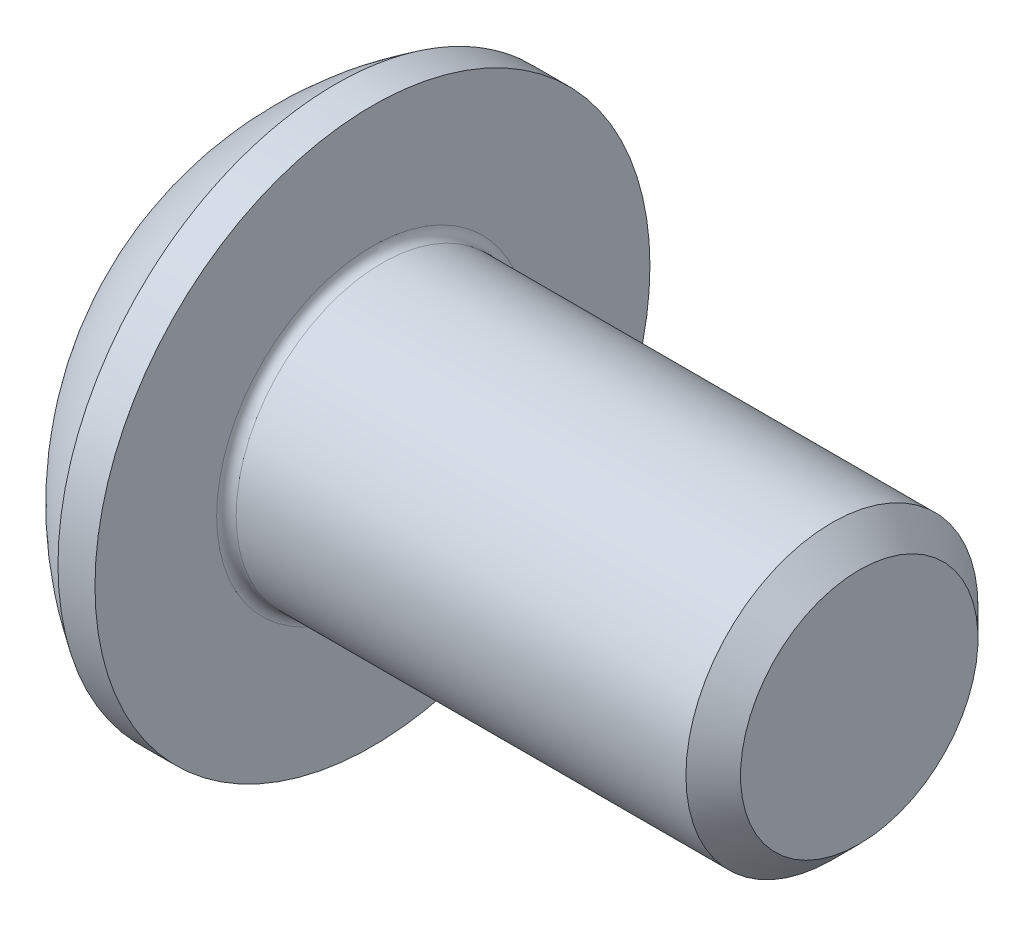
ISO-10303-21;
HEADER;
FILE_DESCRIPTION(('STEP AP214'),'2;1');
FILE_NAME('part.step','',(''),(''),'','','');
FILE_SCHEMA(('AUTOMOTIVE_DESIGN { 1 0 10303 214 1 1 1 1 }'));
ENDSEC;
DATA;
#1=APPLICATION_CONTEXT('core data for automotive mechanical design processes');
#2=APPLICATION_PROTOCOL_DEFINITION('international standard','automotive_design',2000,#1);
#3=PRODUCT_CONTEXT('',#1,'mechanical');
#4=PRODUCT('Part','Part','',(#3));
#5=PRODUCT_RELATED_PRODUCT_CATEGORY('part','',(#4));
#6=PRODUCT_DEFINITION_FORMATION('','',#4);
#7=PRODUCT_DEFINITION_CONTEXT('part definition',#1,'design');
#8=PRODUCT_DEFINITION('design','',#6,#7);
#9=PRODUCT_DEFINITION_SHAPE('','',#8);
#10=(LENGTH_UNIT() NAMED_UNIT(*) SI_UNIT(.MILLI.,.METRE.));
#11=(NAMED_UNIT(*) PLANE_ANGLE_UNIT() SI_UNIT($,.RADIAN.));
#12=(NAMED_UNIT(*) SI_UNIT($,.STERADIAN.) SOLID_ANGLE_UNIT());
#13=UNCERTAINTY_MEASURE_WITH_UNIT(LENGTH_MEASURE(1.E-05),#10,'distance_accuracy_value','');
#14=(GEOMETRIC_REPRESENTATION_CONTEXT(3) GLOBAL_UNCERTAINTY_ASSIGNED_CONTEXT((#13)) GLOBAL_UNIT_ASSIGNED_CONTEXT((#10,
#11,#12)) REPRESENTATION_CONTEXT('',''));
#15=CARTESIAN_POINT('',(0.,0.,0.));
#16=DIRECTION('',(0.,0.,1.));
#17=DIRECTION('',(1.,0.,0.));
#18=AXIS2_PLACEMENT_3D('',#15,#16,#17);
#19=CARTESIAN_POINT('',(1.04000000000026,0.,0.));
#20=DIRECTION('',(-1.,0.,0.));
#21=DIRECTION('',(0.,0.,1.));
#22=AXIS2_PLACEMENT_3D('',#19,#20,#21);
#23=CONICAL_SURFACE('',#22,0.99999999999989,1.04719755119658);
#24=CARTESIAN_POINT('',(1.61735026918985,0.,3.33066907387547E-13));
#25=VERTEX_POINT('',#24);
#26=VERTEX_LOOP('',#25);
#27=FACE_BOUND('',#26,.T.);
#28=CARTESIAN_POINT('',(1.04000000000013,0.,0.));
#29=DIRECTION('',(-1.,0.,0.));
#30=DIRECTION('',(0.,0.,1.));
#31=AXIS2_PLACEMENT_3D('',#28,#29,#30);
#32=CIRCLE('',#31,1.00000000000011);
#33=CARTESIAN_POINT('',(1.04000000000007,-0.866025403784487,0.500000000000026));
#34=VERTEX_POINT('',#33);
#35=CARTESIAN_POINT('',(1.04000000000016,0.,0.999999999999973));
#36=VERTEX_POINT('',#35);
#37=EDGE_CURVE('E98',#34,#36,#32,.T.);
#38=ORIENTED_EDGE('',*,*,#37,.T.);
#39=CARTESIAN_POINT('',(1.04000000000013,0.,0.));
#40=DIRECTION('',(-1.,0.,0.));
#41=DIRECTION('',(0.,0.,1.));
#42=AXIS2_PLACEMENT_3D('',#39,#40,#41);
#43=CIRCLE('',#42,1.00000000000011);
#44=CARTESIAN_POINT('',(1.04000000000007,0.866025403784489,0.500000000000026));
#45=VERTEX_POINT('',#44);
#46=EDGE_CURVE('E159',#36,#45,#43,.T.);
#47=ORIENTED_EDGE('',*,*,#46,.T.);
#48=CARTESIAN_POINT('',(1.04000000000013,0.,0.));
#49=DIRECTION('',(-1.,0.,0.));
#50=DIRECTION('',(0.,0.,1.));
#51=AXIS2_PLACEMENT_3D('',#48,#49,#50);
#52=CIRCLE('',#51,1.00000000000011);
#53=CARTESIAN_POINT('',(1.04000000000007,0.866025403784489,-0.500000000000027));
#54=VERTEX_POINT('',#53);
#55=EDGE_CURVE('E356',#45,#54,#52,.T.);
#56=ORIENTED_EDGE('',*,*,#55,.T.);
#57=CARTESIAN_POINT('',(1.04000000000013,0.,0.));
#58=DIRECTION('',(-1.,0.,0.));
#59=DIRECTION('',(0.,0.,1.));
#60=AXIS2_PLACEMENT_3D('',#57,#58,#59);
#61=CIRCLE('',#60,1.00000000000011);
#62=CARTESIAN_POINT('',(1.04000000000016,0.,-0.999999999999973));
#63=VERTEX_POINT('',#62);
#64=EDGE_CURVE('E357',#54,#63,#61,.T.);
#65=ORIENTED_EDGE('',*,*,#64,.T.);
#66=CARTESIAN_POINT('',(1.04000000000013,0.,0.));
#67=DIRECTION('',(-1.,0.,0.));
#68=DIRECTION('',(0.,0.,1.));
#69=AXIS2_PLACEMENT_3D('',#66,#67,#68);
#70=CIRCLE('',#69,1.00000000000011);
#71=CARTESIAN_POINT('',(1.04000000000007,-0.866025403784488,-0.500000000000025));
#72=VERTEX_POINT('',#71);
#73=EDGE_CURVE('E101',#63,#72,#70,.T.);
#74=ORIENTED_EDGE('',*,*,#73,.T.);
#75=CARTESIAN_POINT('',(1.04000000000013,0.,0.));
#76=DIRECTION('',(-1.,0.,0.));
#77=DIRECTION('',(0.,0.,1.));
#78=AXIS2_PLACEMENT_3D('',#75,#76,#77);
#79=CIRCLE('',#78,1.00000000000011);
#80=EDGE_CURVE('E96',#72,#34,#79,.T.);
#81=ORIENTED_EDGE('',*,*,#80,.T.);
#82=EDGE_LOOP('',(#38,#47,#56,#65,#74,#81));
#83=FACE_BOUND('',#82,.T.);
#84=ADVANCED_FACE('F17',(#27,#83),#23,.F.);
#85=CARTESIAN_POINT('',(1.04,-1.73205080756887,-0.999999999999999));
#86=DIRECTION('',(1.,0.,0.));
#87=DIRECTION('',(0.,0.,-1.));
#88=AXIS2_PLACEMENT_3D('',#85,#86,#87);
#89=PLANE('',#88);
#90=DIRECTION('',(0.,0.499999999999999,0.866025403784439));
#91=VECTOR('',#90,1.);
#92=CARTESIAN_POINT('',(1.04,-1.15470053837925,0.));
#93=LINE('',#92,#91);
#94=CARTESIAN_POINT('',(1.04,-0.577350269189625,0.999999999999999));
#95=VERTEX_POINT('',#94);
#96=EDGE_CURVE('E110',#95,#34,#93,.F.);
#97=ORIENTED_EDGE('',*,*,#96,.F.);
#98=DIRECTION('',(0.,1.,0.));
#99=VECTOR('',#98,1.);
#100=CARTESIAN_POINT('',(1.04,-0.577350269189625,0.999999999999998));
#101=LINE('',#100,#99);
#102=EDGE_CURVE('E112',#36,#95,#101,.F.);
#103=ORIENTED_EDGE('',*,*,#102,.F.);
#104=ORIENTED_EDGE('',*,*,#37,.F.);
#105=EDGE_LOOP('',(#97,#103,#104));
#106=FACE_BOUND('',#105,.T.);
#107=ADVANCED_FACE('F108',(#106),#89,.F.);
#108=CARTESIAN_POINT('',(1.04,-1.73205080756887,-0.999999999999999));
#109=DIRECTION('',(1.,0.,0.));
#110=DIRECTION('',(0.,0.,-1.));
#111=AXIS2_PLACEMENT_3D('',#108,#109,#110);
#112=PLANE('',#111);
#113=DIRECTION('',(0.,-0.499999999999997,0.86602540378444));
#114=VECTOR('',#113,1.);
#115=CARTESIAN_POINT('',(1.04,-0.577350269189626,-1.));
#116=LINE('',#115,#114);
#117=CARTESIAN_POINT('',(1.04,-1.15470053837925,0.));
#118=VERTEX_POINT('',#117);
#119=EDGE_CURVE('E119',#118,#72,#116,.F.);
#120=ORIENTED_EDGE('',*,*,#119,.F.);
#121=DIRECTION('',(0.,0.499999999999999,0.866025403784439));
#122=VECTOR('',#121,1.);
#123=CARTESIAN_POINT('',(1.04,-1.15470053837925,0.));
#124=LINE('',#123,#122);
#125=EDGE_CURVE('E116',#34,#118,#124,.F.);
#126=ORIENTED_EDGE('',*,*,#125,.F.);
#127=ORIENTED_EDGE('',*,*,#80,.F.);
#128=EDGE_LOOP('',(#120,#126,#127));
#129=FACE_BOUND('',#128,.T.);
#130=ADVANCED_FACE('F117',(#129),#112,.F.);
#131=CARTESIAN_POINT('',(1.04,-1.73205080756887,-0.999999999999999));
#132=DIRECTION('',(1.,0.,0.));
#133=DIRECTION('',(0.,0.,-1.));
#134=AXIS2_PLACEMENT_3D('',#131,#132,#133);
#135=PLANE('',#134);
#136=DIRECTION('',(0.,-1.,0.));
#137=VECTOR('',#136,1.);
#138=CARTESIAN_POINT('',(1.04,0.577350269189628,-1.));
#139=LINE('',#138,#137);
#140=CARTESIAN_POINT('',(1.04,-0.577350269189626,-1.));
#141=VERTEX_POINT('',#140);
#142=EDGE_CURVE('E325',#141,#63,#139,.F.);
#143=ORIENTED_EDGE('',*,*,#142,.F.);
#144=DIRECTION('',(0.,-0.499999999999997,0.86602540378444));
#145=VECTOR('',#144,1.);
#146=CARTESIAN_POINT('',(1.04,-0.577350269189626,-1.));
#147=LINE('',#146,#145);
#148=EDGE_CURVE('E337',#72,#141,#147,.F.);
#149=ORIENTED_EDGE('',*,*,#148,.F.);
#150=ORIENTED_EDGE('',*,*,#73,.F.);
#151=EDGE_LOOP('',(#143,#149,#150));
#152=FACE_BOUND('',#151,.T.);
#153=ADVANCED_FACE('F203',(#152),#135,.F.);
#154=CARTESIAN_POINT('',(1.04,-1.73205080756887,-0.999999999999999));
#155=DIRECTION('',(1.,0.,0.));
#156=DIRECTION('',(0.,0.,-1.));
#157=AXIS2_PLACEMENT_3D('',#154,#155,#156);
#158=PLANE('',#157);
#159=DIRECTION('',(0.,-0.499999999999998,-0.86602540378444));
#160=VECTOR('',#159,1.);
#161=CARTESIAN_POINT('',(1.04,1.15470053837925,0.));
#162=LINE('',#161,#160);
#163=CARTESIAN_POINT('',(1.04,0.577350269189628,-1.));
#164=VERTEX_POINT('',#163);
#165=EDGE_CURVE('E310',#164,#54,#162,.F.);
#166=ORIENTED_EDGE('',*,*,#165,.F.);
#167=DIRECTION('',(0.,-1.,0.));
#168=VECTOR('',#167,1.);
#169=CARTESIAN_POINT('',(1.04,0.577350269189628,-1.));
#170=LINE('',#169,#168);
#171=EDGE_CURVE('E322',#63,#164,#170,.F.);
#172=ORIENTED_EDGE('',*,*,#171,.F.);
#173=ORIENTED_EDGE('',*,*,#64,.F.);
#174=EDGE_LOOP('',(#166,#172,#173));
#175=FACE_BOUND('',#174,.T.);
#176=ADVANCED_FACE('F199',(#175),#158,.F.);
#177=CARTESIAN_POINT('',(1.04,-1.73205080756887,-0.999999999999999));
#178=DIRECTION('',(1.,0.,0.));
#179=DIRECTION('',(0.,0.,-1.));
#180=AXIS2_PLACEMENT_3D('',#177,#178,#179);
#181=PLANE('',#180);
#182=DIRECTION('',(0.,0.499999999999998,-0.86602540378444));
#183=VECTOR('',#182,1.);
#184=CARTESIAN_POINT('',(1.04,0.577350269189628,1.));
#185=LINE('',#184,#183);
#186=CARTESIAN_POINT('',(1.04,1.15470053837925,0.));
#187=VERTEX_POINT('',#186);
#188=EDGE_CURVE('E288',#187,#45,#185,.F.);
#189=ORIENTED_EDGE('',*,*,#188,.F.);
#190=DIRECTION('',(0.,-0.499999999999998,-0.86602540378444));
#191=VECTOR('',#190,1.);
#192=CARTESIAN_POINT('',(1.04,1.15470053837925,0.));
#193=LINE('',#192,#191);
#194=EDGE_CURVE('E307',#54,#187,#193,.F.);
#195=ORIENTED_EDGE('',*,*,#194,.F.);
#196=ORIENTED_EDGE('',*,*,#55,.F.);
#197=EDGE_LOOP('',(#189,#195,#196));
#198=FACE_BOUND('',#197,.T.);
#199=ADVANCED_FACE('F195',(#198),#181,.F.);
#200=CARTESIAN_POINT('',(1.04,-1.73205080756887,-0.999999999999999));
#201=DIRECTION('',(1.,0.,0.));
#202=DIRECTION('',(0.,0.,-1.));
#203=AXIS2_PLACEMENT_3D('',#200,#201,#202);
#204=PLANE('',#203);
#205=DIRECTION('',(0.,1.,0.));
#206=VECTOR('',#205,1.);
#207=CARTESIAN_POINT('',(1.04,-0.577350269189625,0.999999999999998));
#208=LINE('',#207,#206);
#209=CARTESIAN_POINT('',(1.04,0.577350269189628,1.));
#210=VERTEX_POINT('',#209);
#211=EDGE_CURVE('E128',#210,#36,#208,.F.);
#212=ORIENTED_EDGE('',*,*,#211,.F.);
#213=DIRECTION('',(0.,0.499999999999998,-0.86602540378444));
#214=VECTOR('',#213,1.);
#215=CARTESIAN_POINT('',(1.04,0.577350269189628,1.));
#216=LINE('',#215,#214);
#217=EDGE_CURVE('E291',#45,#210,#216,.F.);
#218=ORIENTED_EDGE('',*,*,#217,.F.);
#219=ORIENTED_EDGE('',*,*,#46,.F.);
#220=EDGE_LOOP('',(#212,#218,#219));
#221=FACE_BOUND('',#220,.T.);
#222=ADVANCED_FACE('F191',(#221),#204,.F.);
#223=CARTESIAN_POINT('',(1.04,-0.577350269189625,0.999999999999998));
#224=DIRECTION('',(0.,0.,-1.));
#225=DIRECTION('',(0.,1.,0.));
#226=AXIS2_PLACEMENT_3D('',#223,#224,#225);
#227=PLANE('',#226);
#228=DIRECTION('',(0.,1.,0.));
#229=VECTOR('',#228,1.);
#230=CARTESIAN_POINT('',(0.,0.,1.));
#231=LINE('',#230,#229);
#232=CARTESIAN_POINT('',(0.,0.577350269189628,1.));
#233=VERTEX_POINT('',#232);
#234=CARTESIAN_POINT('',(0.,-0.577350269189625,0.999999999999999));
#235=VERTEX_POINT('',#234);
#236=EDGE_CURVE('E284',#233,#235,#231,.F.);
#237=ORIENTED_EDGE('',*,*,#236,.F.);
#238=DIRECTION('',(1.,0.,0.));
#239=VECTOR('',#238,1.);
#240=CARTESIAN_POINT('',(1.04,0.577350269189628,1.));
#241=LINE('',#240,#239);
#242=EDGE_CURVE('E297',#210,#233,#241,.F.);
#243=ORIENTED_EDGE('',*,*,#242,.F.);
#244=ORIENTED_EDGE('',*,*,#211,.T.);
#245=ORIENTED_EDGE('',*,*,#102,.T.);
#246=DIRECTION('',(1.,0.,0.));
#247=VECTOR('',#246,1.);
#248=CARTESIAN_POINT('',(1.04,-0.577350269189625,0.999999999999999));
#249=LINE('',#248,#247);
#250=EDGE_CURVE('E122',#235,#95,#249,.T.);
#251=ORIENTED_EDGE('',*,*,#250,.F.);
#252=EDGE_LOOP('',(#237,#243,#244,#245,#251));
#253=FACE_BOUND('',#252,.T.);
#254=ADVANCED_FACE('F188',(#253),#227,.T.);
#255=CARTESIAN_POINT('',(1.04,-1.15470053837925,0.));
#256=DIRECTION('',(0.,0.866025403784439,-0.499999999999999));
#257=DIRECTION('',(0.,0.499999999999999,0.866025403784439));
#258=AXIS2_PLACEMENT_3D('',#255,#256,#257);
#259=PLANE('',#258);
#260=DIRECTION('',(0.,-0.499999999999999,-0.866025403784439));
#261=VECTOR('',#260,1.);
#262=CARTESIAN_POINT('',(0.,-0.577350269189625,0.999999999999998));
#263=LINE('',#262,#261);
#264=CARTESIAN_POINT('',(0.,-1.15470053837925,0.));
#265=VERTEX_POINT('',#264);
#266=EDGE_CURVE('E281',#235,#265,#263,.T.);
#267=ORIENTED_EDGE('',*,*,#266,.F.);
#268=ORIENTED_EDGE('',*,*,#250,.T.);
#269=ORIENTED_EDGE('',*,*,#96,.T.);
#270=ORIENTED_EDGE('',*,*,#125,.T.);
#271=DIRECTION('',(1.,0.,0.));
#272=VECTOR('',#271,1.);
#273=CARTESIAN_POINT('',(1.04,-1.15470053837925,0.));
#274=LINE('',#273,#272);
#275=EDGE_CURVE('E334',#265,#118,#274,.T.);
#276=ORIENTED_EDGE('',*,*,#275,.F.);
#277=EDGE_LOOP('',(#267,#268,#269,#270,#276));
#278=FACE_BOUND('',#277,.T.);
#279=ADVANCED_FACE('F126',(#278),#259,.T.);
#280=CARTESIAN_POINT('',(1.04,-0.577350269189626,-1.));
#281=DIRECTION('',(0.,0.86602540378444,0.499999999999997));
#282=DIRECTION('',(0.,-0.499999999999997,0.86602540378444));
#283=AXIS2_PLACEMENT_3D('',#280,#281,#282);
#284=PLANE('',#283);
#285=DIRECTION('',(0.,0.499999999999997,-0.86602540378444));
#286=VECTOR('',#285,1.);
#287=CARTESIAN_POINT('',(0.,-1.15470053837925,0.));
#288=LINE('',#287,#286);
#289=CARTESIAN_POINT('',(0.,-0.577350269189626,-1.));
#290=VERTEX_POINT('',#289);
#291=EDGE_CURVE('E278',#265,#290,#288,.T.);
#292=ORIENTED_EDGE('',*,*,#291,.F.);
#293=ORIENTED_EDGE('',*,*,#275,.T.);
#294=ORIENTED_EDGE('',*,*,#119,.T.);
#295=ORIENTED_EDGE('',*,*,#148,.T.);
#296=DIRECTION('',(1.,0.,0.));
#297=VECTOR('',#296,1.);
#298=CARTESIAN_POINT('',(1.04,-0.577350269189626,-1.));
#299=LINE('',#298,#297);
#300=EDGE_CURVE('E319',#290,#141,#299,.T.);
#301=ORIENTED_EDGE('',*,*,#300,.F.);
#302=EDGE_LOOP('',(#292,#293,#294,#295,#301));
#303=FACE_BOUND('',#302,.T.);
#304=ADVANCED_FACE('F181',(#303),#284,.T.);
#305=CARTESIAN_POINT('',(1.04,0.577350269189628,-1.));
#306=DIRECTION('',(0.,0.,1.));
#307=DIRECTION('',(0.,-1.,0.));
#308=AXIS2_PLACEMENT_3D('',#305,#306,#307);
#309=PLANE('',#308);
#310=DIRECTION('',(0.,1.,0.));
#311=VECTOR('',#310,1.);
#312=CARTESIAN_POINT('',(0.,0.,-1.));
#313=LINE('',#312,#311);
#314=CARTESIAN_POINT('',(0.,0.577350269189628,-1.));
#315=VERTEX_POINT('',#314);
#316=EDGE_CURVE('E275',#290,#315,#313,.T.);
#317=ORIENTED_EDGE('',*,*,#316,.F.);
#318=ORIENTED_EDGE('',*,*,#300,.T.);
#319=ORIENTED_EDGE('',*,*,#142,.T.);
#320=ORIENTED_EDGE('',*,*,#171,.T.);
#321=DIRECTION('',(1.,0.,0.));
#322=VECTOR('',#321,1.);
#323=CARTESIAN_POINT('',(1.04,0.577350269189628,-1.));
#324=LINE('',#323,#322);
#325=EDGE_CURVE('E292',#315,#164,#324,.T.);
#326=ORIENTED_EDGE('',*,*,#325,.F.);
#327=EDGE_LOOP('',(#317,#318,#319,#320,#326));
#328=FACE_BOUND('',#327,.T.);
#329=ADVANCED_FACE('F177',(#328),#309,.T.);
#330=CARTESIAN_POINT('',(1.04,1.15470053837925,0.));
#331=DIRECTION('',(0.,-0.86602540378444,0.499999999999998));
#332=DIRECTION('',(0.,-0.499999999999998,-0.86602540378444));
#333=AXIS2_PLACEMENT_3D('',#330,#331,#332);
#334=PLANE('',#333);
#335=DIRECTION('',(0.,0.499999999999998,0.866025403784439));
#336=VECTOR('',#335,1.);
#337=CARTESIAN_POINT('',(0.,0.577350269189628,-1.));
#338=LINE('',#337,#336);
#339=CARTESIAN_POINT('',(0.,1.15470053837925,0.));
#340=VERTEX_POINT('',#339);
#341=EDGE_CURVE('E272',#315,#340,#338,.T.);
#342=ORIENTED_EDGE('',*,*,#341,.F.);
#343=ORIENTED_EDGE('',*,*,#325,.T.);
#344=ORIENTED_EDGE('',*,*,#165,.T.);
#345=ORIENTED_EDGE('',*,*,#194,.T.);
#346=DIRECTION('',(1.,0.,0.));
#347=VECTOR('',#346,1.);
#348=CARTESIAN_POINT('',(1.04,1.15470053837925,0.));
#349=LINE('',#348,#347);
#350=EDGE_CURVE('E287',#340,#187,#349,.T.);
#351=ORIENTED_EDGE('',*,*,#350,.F.);
#352=EDGE_LOOP('',(#342,#343,#344,#345,#351));
#353=FACE_BOUND('',#352,.T.);
#354=ADVANCED_FACE('F173',(#353),#334,.T.);
#355=CARTESIAN_POINT('',(1.04,0.577350269189628,1.));
#356=DIRECTION('',(0.,-0.86602540378444,-0.499999999999998));
#357=DIRECTION('',(0.,0.499999999999998,-0.86602540378444));
#358=AXIS2_PLACEMENT_3D('',#355,#356,#357);
#359=PLANE('',#358);
#360=DIRECTION('',(0.,-0.499999999999998,0.866025403784439));
#361=VECTOR('',#360,1.);
#362=CARTESIAN_POINT('',(0.,1.15470053837925,0.));
#363=LINE('',#362,#361);
#364=EDGE_CURVE('E158',#340,#233,#363,.T.);
#365=ORIENTED_EDGE('',*,*,#364,.F.);
#366=ORIENTED_EDGE('',*,*,#350,.T.);
#367=ORIENTED_EDGE('',*,*,#188,.T.);
#368=ORIENTED_EDGE('',*,*,#217,.T.);
#369=ORIENTED_EDGE('',*,*,#242,.T.);
#370=EDGE_LOOP('',(#365,#366,#367,#368,#369));
#371=FACE_BOUND('',#370,.T.);
#372=ADVANCED_FACE('F169',(#371),#359,.T.);
#373=CARTESIAN_POINT('',(0.,0.,0.));
#374=DIRECTION('',(-1.,0.,0.));
#375=DIRECTION('',(0.,0.,1.));
#376=AXIS2_PLACEMENT_3D('',#373,#374,#375);
#377=PLANE('',#376);
#378=ORIENTED_EDGE('',*,*,#341,.T.);
#379=ORIENTED_EDGE('',*,*,#364,.T.);
#380=ORIENTED_EDGE('',*,*,#236,.T.);
#381=ORIENTED_EDGE('',*,*,#266,.T.);
#382=ORIENTED_EDGE('',*,*,#291,.T.);
#383=ORIENTED_EDGE('',*,*,#316,.T.);
#384=EDGE_LOOP('',(#378,#379,#380,#381,#382,#383));
#385=FACE_BOUND('',#384,.T.);
#386=CARTESIAN_POINT('',(0.,1.425,0.));
#387=CARTESIAN_POINT('',(1.4338123437925E-13,1.4249954713384,0.0799833360146291));
#388=CARTESIAN_POINT('',(1.15184834850223E-13,1.41822890220767,0.160109019716956));
#389=CARTESIAN_POINT('',(0.,1.39809415024756,0.278523524351213));
#390=CARTESIAN_POINT('',(-1.36371698945797E-13,1.38970085869302,0.317749539599063));
#391=CARTESIAN_POINT('',(1.37350310557856E-13,1.36963357855865,0.395393827236254));
#392=CARTESIAN_POINT('',(4.90702889339482E-13,1.35795692767265,0.433811416830825));
#393=CARTESIAN_POINT('',(8.08323358908285E-13,1.31816256652494,0.547245538496227));
#394=CARTESIAN_POINT('',(0.,1.28524776326109,0.620634351866309));
#395=CARTESIAN_POINT('',(0.,1.20754836567178,0.760838579302564));
#396=CARTESIAN_POINT('',(6.6863372592463E-13,1.16276332012518,0.827653743353507));
#397=CARTESIAN_POINT('',(4.22782595577366E-13,1.08769646787854,0.921494986115556));
#398=CARTESIAN_POINT('',(1.23450677297426E-13,1.06133948212697,0.951729494931907));
#399=CARTESIAN_POINT('',(-1.22464708646666E-13,1.00620185445047,1.00984457256203));
#400=CARTESIAN_POINT('',(0.,0.977423573796233,1.03772738282292));
#401=CARTESIAN_POINT('',(1.40032245964886E-13,0.887686851976215,1.11760418663801));
#402=CARTESIAN_POINT('',(3.46567737658904E-13,0.82331026114336,1.16584685143027));
#403=CARTESIAN_POINT('',(3.19566586273256E-13,0.687406523979006,1.25081092212941));
#404=CARTESIAN_POINT('',(0.,0.615879647408102,1.28753276246912));
#405=CARTESIAN_POINT('',(0.,0.467668101636277,1.34845363272005));
#406=CARTESIAN_POINT('',(0.,0.390983487532283,1.3726527963793));
#407=CARTESIAN_POINT('',(0.,0.234641768263904,1.40783152102361));
#408=CARTESIAN_POINT('',(0.,0.154984647227414,1.41881101141001));
#409=CARTESIAN_POINT('',(0.,-0.0050423119243791,1.42724192135212));
#410=CARTESIAN_POINT('',(0.,-0.0854121500396832,1.42469334090783));
#411=CARTESIAN_POINT('',(0.,-0.244584849637596,1.40613727575181));
#412=CARTESIAN_POINT('',(0.,-0.323387719486151,1.39012986291571));
#413=CARTESIAN_POINT('',(0.,-0.477180160001693,1.34511986433297));
#414=CARTESIAN_POINT('',(0.,-0.552169689930598,1.31611713978929));
#415=CARTESIAN_POINT('',(0.,-0.696248843253839,1.2459037745185));
#416=CARTESIAN_POINT('',(0.,-0.765338244029829,1.2046926734179));
#417=CARTESIAN_POINT('',(0.,-0.862971403767651,1.13468732254875));
#418=CARTESIAN_POINT('',(0.,-0.894520211596415,1.10998280332573));
#419=CARTESIAN_POINT('',(0.,-0.955459158435813,1.05798313994378));
#420=CARTESIAN_POINT('',(0.,-0.984847184771994,1.03068551863103));
#421=CARTESIAN_POINT('',(0.,-1.06935902683459,0.94525156928671));
#422=CARTESIAN_POINT('',(0.,-1.12091688115598,0.883512164450251));
#423=CARTESIAN_POINT('',(0.,-1.21291837674087,0.752248511496185));
#424=CARTESIAN_POINT('',(0.,-1.25336244045678,0.682724559422701));
#425=CARTESIAN_POINT('',(0.,-1.30485581691191,0.574099869234607));
#426=CARTESIAN_POINT('',(0.,-1.32050463064866,0.537121902892366));
#427=CARTESIAN_POINT('',(0.,-1.3486194462549,0.462016055729021));
#428=CARTESIAN_POINT('',(0.,-1.36108802394627,0.423889133669848));
#429=CARTESIAN_POINT('',(1.82457274270147E-13,-1.39355394851487,0.308245859389803));
#430=CARTESIAN_POINT('',(9.90816331623969E-13,-1.40870242218991,0.229274754599029));
#431=CARTESIAN_POINT('',(3.76736671278537E-13,-1.41974083887092,0.124862105658296));
#432=CARTESIAN_POINT('',(1.05666134262286E-13,-1.42171132206519,0.0999338996932164));
#433=CARTESIAN_POINT('',(-1.04798772524366E-13,-1.42434161069697,0.0500084356096741));
#434=CARTESIAN_POINT('',(0.,-1.42500141613448,0.0250111774912109));
#435=CARTESIAN_POINT('',(1.41325411445731E-13,-1.42499547133842,-0.0799833360146299));
#436=CARTESIAN_POINT('',(1.14807073805861E-13,-1.41822890220769,-0.160109019716957));
#437=CARTESIAN_POINT('',(0.,-1.39809415024758,-0.278523524351214));
#438=CARTESIAN_POINT('',(-1.36319731350917E-13,-1.38970085869304,-0.317749539599064));
#439=CARTESIAN_POINT('',(1.37298300703027E-13,-1.36963357855866,-0.395393827236255));
#440=CARTESIAN_POINT('',(4.90684450465061E-13,-1.35795692767266,-0.433811416830826));
#441=CARTESIAN_POINT('',(8.08360148761191E-13,-1.31816256652495,-0.547245538496227));
#442=CARTESIAN_POINT('',(0.,-1.28524776326111,-0.62063435186631));
#443=CARTESIAN_POINT('',(0.,-1.2075483656718,-0.760838579302564));
#444=CARTESIAN_POINT('',(6.6861715765257E-13,-1.1627633201252,-0.827653743353506));
#445=CARTESIAN_POINT('',(4.22790890568709E-13,-1.08769646787856,-0.921494986115555));
#446=CARTESIAN_POINT('',(1.23472229400832E-13,-1.06133948212699,-0.951729494931907));
#447=CARTESIAN_POINT('',(-1.22486239970599E-13,-1.00620185445049,-1.00984457256203));
#448=CARTESIAN_POINT('',(0.,-0.977423573796249,-1.03772738282292));
#449=CARTESIAN_POINT('',(1.40187805590937E-13,-0.887686851976231,-1.11760418663801));
#450=CARTESIAN_POINT('',(3.47414825753093E-13,-0.823310261143376,-1.16584685143028));
#451=CARTESIAN_POINT('',(3.20454220890463E-13,-0.687406523979022,-1.25081092212941));
#452=CARTESIAN_POINT('',(0.,-0.615879647408117,-1.28753276246912));
#453=CARTESIAN_POINT('',(0.,-0.467668101636292,-1.34845363272005));
#454=CARTESIAN_POINT('',(0.,-0.390983487532298,-1.3726527963793));
#455=CARTESIAN_POINT('',(0.,-0.234641768263919,-1.40783152102361));
#456=CARTESIAN_POINT('',(0.,-0.15498464722743,-1.41881101141001));
#457=CARTESIAN_POINT('',(0.,0.00504231192436342,-1.42724192135212));
#458=CARTESIAN_POINT('',(0.,0.0854121500396673,-1.42469334090783));
#459=CARTESIAN_POINT('',(0.,0.24458484963758,-1.40613727575181));
#460=CARTESIAN_POINT('',(0.,0.323387719486135,-1.39012986291571));
#461=CARTESIAN_POINT('',(0.,0.477180160001677,-1.34511986433297));
#462=CARTESIAN_POINT('',(0.,0.552169689930583,-1.31611713978929));
#463=CARTESIAN_POINT('',(0.,0.696248843253823,-1.2459037745185));
#464=CARTESIAN_POINT('',(0.,0.765338244029814,-1.2046926734179));
#465=CARTESIAN_POINT('',(0.,0.862971403767635,-1.13468732254875));
#466=CARTESIAN_POINT('',(0.,0.894520211596397,-1.10998280332573));
#467=CARTESIAN_POINT('',(0.,0.955459158435796,-1.05798313994378));
#468=CARTESIAN_POINT('',(0.,0.984847184771979,-1.03068551863103));
#469=CARTESIAN_POINT('',(0.,1.06935902683458,-0.945251569286712));
#470=CARTESIAN_POINT('',(0.,1.12091688115596,-0.88351216445025));
#471=CARTESIAN_POINT('',(0.,1.21291837674086,-0.752248511496185));
#472=CARTESIAN_POINT('',(0.,1.25336244045676,-0.682724559422701));
#473=CARTESIAN_POINT('',(0.,1.30485581691189,-0.574099869234607));
#474=CARTESIAN_POINT('',(0.,1.32050463064864,-0.537121902892366));
#475=CARTESIAN_POINT('',(0.,1.34861944625488,-0.462016055729022));
#476=CARTESIAN_POINT('',(0.,1.36108802394625,-0.423889133669848));
#477=CARTESIAN_POINT('',(1.82633949172699E-13,1.39355394851486,-0.308245859389803));
#478=CARTESIAN_POINT('',(9.9110223406442E-13,1.40870242218989,-0.229274754599028));
#479=CARTESIAN_POINT('',(3.76647268197352E-13,1.4197408388709,-0.124862105658295));
#480=CARTESIAN_POINT('',(1.05448690581168E-13,1.42171132206517,-0.0999338996932162));
#481=CARTESIAN_POINT('',(-1.04581328843247E-13,1.42434161069696,-0.0500084356096743));
#482=CARTESIAN_POINT('',(0.,1.42500141613447,-0.0250111774912114));
#483=CARTESIAN_POINT('',(0.,1.425,0.));
#484=B_SPLINE_CURVE_WITH_KNOTS('',3,(#386,#387,#388,#389,#390,#391,#392,#393,#394,#395,#396,
#397,#398,#399,#400,#401,#402,#403,#404,#405,#406,#407,#408,#409,#410,#411,#412,#413,#414,#415,
#416,#417,#418,#419,#420,#421,#422,#423,#424,#425,#426,#427,#428,#429,#430,#431,#432,#433,#434,
#435,#436,#437,#438,#439,#440,#441,#442,#443,#444,#445,#446,#447,#448,#449,#450,#451,#452,#453,
#454,#455,#456,#457,#458,#459,#460,#461,#462,#463,#464,#465,#466,#467,#468,#469,#470,#471,#472,
#473,#474,#475,#476,#477,#478,#479,#480,#481,#482,#483),.UNSPECIFIED.,.T.,.F.,(4,2,2,2,2,2,2,2,
2,2,2,2,2,2,2,2,2,2,2,2,2,2,2,2,2,2,2,2,2,2,2,2,2,2,2,2,2,2,2,2,2,2,2,2,2,2,2,2,4),(0.,
0.239833624278659,0.360065645132457,0.480395438436413,0.720481427136015,0.960576543485366,
1.08078140880891,1.20087037853761,1.44097126816501,1.68106310286304,1.92115237321536,
2.16124292574037,2.40133347826532,2.64142274861735,2.88151458331522,3.12161547294257,
3.24170444267111,3.36190930799457,3.60200442434418,3.8420904130439,3.96242020634807,
4.08265222720217,4.32248585148062,4.39748299018577,4.47248012889098,4.71231375316963,
4.83254577402343,4.95287556732739,5.19296155602699,5.43305667237634,5.55326153769988,
5.67335050742859,5.91345139705598,6.15354323175401,6.39363250210634,6.63372305463134,
6.87381360715629,7.11390287750832,7.3539947122062,7.59409560183354,7.71418457156209,
7.83438943688555,8.07448455323516,8.31457054193488,8.43490033523905,8.55513235609314,
8.79496598037159,8.86996311907675,8.94496025778195),.UNSPECIFIED.);
#485=CARTESIAN_POINT('',(0.,1.425,0.));
#486=VERTEX_POINT('',#485);
#487=EDGE_CURVE('E151',#486,#486,#484,.T.);
#488=ORIENTED_EDGE('',*,*,#487,.F.);
#489=EDGE_LOOP('',(#488));
#490=FACE_BOUND('',#489,.T.);
#491=ADVANCED_FACE('F165',(#385,#490),#377,.T.);
#492=CARTESIAN_POINT('',(3.03337598425198,0.,0.));
#493=DIRECTION('',(0.,1.,0.));
#494=DIRECTION('',(1.,0.,0.));
#495=AXIS2_PLACEMENT_3D('',#492,#493,#494);
#496=SPHERICAL_SURFACE('',#495,3.35141684393879);
#497=CARTESIAN_POINT('',(1.27,0.,0.));
#498=DIRECTION('',(-1.,0.,0.));
#499=DIRECTION('',(0.,0.,1.));
#500=AXIS2_PLACEMENT_3D('',#497,#498,#499);
#501=CIRCLE('',#500,2.85);
#502=CARTESIAN_POINT('',(1.27,0.,2.85));
#503=VERTEX_POINT('',#502);
#504=EDGE_CURVE('E148',#503,#503,#501,.F.);
#505=ORIENTED_EDGE('',*,*,#504,.F.);
#506=EDGE_LOOP('',(#505));
#507=FACE_BOUND('',#506,.T.);
#508=ORIENTED_EDGE('',*,*,#487,.T.);
#509=EDGE_LOOP('',(#508));
#510=FACE_BOUND('',#509,.T.);
#511=ADVANCED_FACE('F161',(#507,#510),#496,.T.);
#512=CARTESIAN_POINT('',(0.,0.,0.));
#513=DIRECTION('',(-1.,0.,0.));
#514=DIRECTION('',(0.,0.,1.));
#515=AXIS2_PLACEMENT_3D('',#512,#513,#514);
#516=CYLINDRICAL_SURFACE('',#515,2.85);
#517=ORIENTED_EDGE('',*,*,#504,.T.);
#518=EDGE_LOOP('',(#517));
#519=FACE_BOUND('',#518,.T.);
#520=CARTESIAN_POINT('',(1.65,0.,0.));
#521=DIRECTION('',(-1.,0.,0.));
#522=DIRECTION('',(0.,0.,1.));
#523=AXIS2_PLACEMENT_3D('',#520,#521,#522);
#524=CIRCLE('',#523,2.85);
#525=CARTESIAN_POINT('',(1.65,0.,2.85));
#526=VERTEX_POINT('',#525);
#527=EDGE_CURVE('E145',#526,#526,#524,.T.);
#528=ORIENTED_EDGE('',*,*,#527,.T.);
#529=EDGE_LOOP('',(#528));
#530=FACE_BOUND('',#529,.T.);
#531=ADVANCED_FACE('F370',(#519,#530),#516,.T.);
#532=CARTESIAN_POINT('',(6.65,0.,0.));
#533=DIRECTION('',(-1.,0.,0.));
#534=DIRECTION('',(0.,0.,1.));
#535=AXIS2_PLACEMENT_3D('',#532,#533,#534);
#536=PLANE('',#535);
#537=CARTESIAN_POINT('',(6.64999999997917,0.,0.));
#538=DIRECTION('',(-1.,0.,0.));
#539=DIRECTION('',(0.,-1.,0.));
#540=AXIS2_PLACEMENT_3D('',#537,#538,#539);
#541=CIRCLE('',#540,1.21950000004745);
#542=CARTESIAN_POINT('',(6.64999999997917,-1.21950000004745,0.));
#543=VERTEX_POINT('',#542);
#544=EDGE_CURVE('E141',#543,#543,#541,.T.);
#545=ORIENTED_EDGE('',*,*,#544,.F.);
#546=EDGE_LOOP('',(#545));
#547=FACE_BOUND('',#546,.T.);
#548=ADVANCED_FACE('F248',(#547),#536,.F.);
#549=CARTESIAN_POINT('',(1.65,1.49999999999999,0.));
#550=DIRECTION('',(-1.,0.,0.));
#551=DIRECTION('',(0.,0.,1.));
#552=AXIS2_PLACEMENT_3D('',#549,#550,#551);
#553=PLANE('',#552);
#554=ORIENTED_EDGE('',*,*,#527,.F.);
#555=EDGE_LOOP('',(#554));
#556=FACE_BOUND('',#555,.T.);
#557=CARTESIAN_POINT('',(1.65,0.,0.));
#558=DIRECTION('',(1.,0.,0.));
#559=DIRECTION('',(0.,0.,1.));
#560=AXIS2_PLACEMENT_3D('',#557,#558,#559);
#561=CIRCLE('',#560,1.6);
#562=CARTESIAN_POINT('',(1.65,0.,-1.59999999999999));
#563=VERTEX_POINT('',#562);
#564=CARTESIAN_POINT('',(1.65,0.,1.59999999999999));
#565=VERTEX_POINT('',#564);
#566=EDGE_CURVE('E144',#563,#565,#561,.F.);
#567=ORIENTED_EDGE('',*,*,#566,.T.);
#568=CARTESIAN_POINT('',(1.65,0.,0.));
#569=DIRECTION('',(1.,0.,0.));
#570=DIRECTION('',(0.,0.,-1.));
#571=AXIS2_PLACEMENT_3D('',#568,#569,#570);
#572=CIRCLE('',#571,1.6);
#573=EDGE_CURVE('E36',#565,#563,#572,.F.);
#574=ORIENTED_EDGE('',*,*,#573,.T.);
#575=EDGE_LOOP('',(#567,#574));
#576=FACE_BOUND('',#575,.T.);
#577=ADVANCED_FACE('F239',(#556,#576),#553,.F.);
#578=CARTESIAN_POINT('',(6.36950000000525,0.,0.));
#579=DIRECTION('',(-1.,0.,0.));
#580=DIRECTION('',(0.,-1.,0.));
#581=AXIS2_PLACEMENT_3D('',#578,#579,#580);
#582=CONICAL_SURFACE('',#581,1.50000000002137,0.785398163397448);
#583=CARTESIAN_POINT('',(6.3695,0.,0.));
#584=DIRECTION('',(-1.,0.,0.));
#585=DIRECTION('',(0.,0.,1.));
#586=AXIS2_PLACEMENT_3D('',#583,#584,#585);
#587=CIRCLE('',#586,1.5);
#588=CARTESIAN_POINT('',(6.3695,0.,1.5));
#589=VERTEX_POINT('',#588);
#590=EDGE_CURVE('E28',#589,#589,#587,.T.);
#591=ORIENTED_EDGE('',*,*,#590,.F.);
#592=EDGE_LOOP('',(#591));
#593=FACE_BOUND('',#592,.T.);
#594=ORIENTED_EDGE('',*,*,#544,.T.);
#595=EDGE_LOOP('',(#594));
#596=FACE_BOUND('',#595,.T.);
#597=ADVANCED_FACE('F223',(#593,#596),#582,.T.);
#598=CARTESIAN_POINT('',(1.75,0.,0.));
#599=DIRECTION('',(-1.,0.,0.));
#600=DIRECTION('',(0.,0.,1.));
#601=AXIS2_PLACEMENT_3D('',#598,#599,#600);
#602=TOROIDAL_SURFACE('',#601,1.6,0.1);
#603=ORIENTED_EDGE('',*,*,#573,.F.);
#604=ORIENTED_EDGE('',*,*,#566,.F.);
#605=EDGE_LOOP('',(#603,#604));
#606=FACE_BOUND('',#605,.T.);
#607=CARTESIAN_POINT('',(1.75,0.,0.));
#608=DIRECTION('',(-1.,0.,0.));
#609=DIRECTION('',(0.,0.,1.));
#610=AXIS2_PLACEMENT_3D('',#607,#608,#609);
#611=CIRCLE('',#610,1.5);
#612=CARTESIAN_POINT('',(1.75,0.,1.5));
#613=VERTEX_POINT('',#612);
#614=EDGE_CURVE('E11',#613,#613,#611,.F.);
#615=ORIENTED_EDGE('',*,*,#614,.F.);
#616=EDGE_LOOP('',(#615));
#617=FACE_BOUND('',#616,.T.);
#618=ADVANCED_FACE('F217',(#606,#617),#602,.F.);
#619=CARTESIAN_POINT('',(0.,0.,0.));
#620=DIRECTION('',(-1.,0.,0.));
#621=DIRECTION('',(0.,0.,1.));
#622=AXIS2_PLACEMENT_3D('',#619,#620,#621);
#623=CYLINDRICAL_SURFACE('',#622,1.5);
#624=ORIENTED_EDGE('',*,*,#614,.T.);
#625=EDGE_LOOP('',(#624));
#626=FACE_BOUND('',#625,.T.);
#627=ORIENTED_EDGE('',*,*,#590,.T.);
#628=EDGE_LOOP('',(#627));
#629=FACE_BOUND('',#628,.T.);
#630=ADVANCED_FACE('F215',(#626,#629),#623,.T.);
#631=CLOSED_SHELL('',(#84,#107,#130,#153,#176,#199,#222,#254,#279,#304,#329,#354,#372,#491,#511,
#531,#548,#577,#597,#618,#630));
#632=MANIFOLD_SOLID_BREP('B1',#631);
#633=ADVANCED_BREP_SHAPE_REPRESENTATION('',(#18,#632),#14);
#634=SHAPE_DEFINITION_REPRESENTATION(#9,#633);
ENDSEC;
END-ISO-10303-21;
